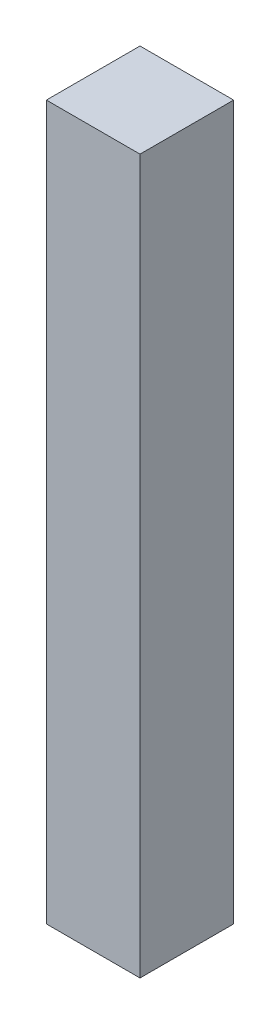
ISO-10303-21;
HEADER;
FILE_DESCRIPTION(('STEP AP214'),'2;1');
FILE_NAME('part.step','',(''),(''),'','','');
FILE_SCHEMA(('AUTOMOTIVE_DESIGN { 1 0 10303 214 1 1 1 1 }'));
ENDSEC;
DATA;
#1=APPLICATION_CONTEXT('core data for automotive mechanical design processes');
#2=APPLICATION_PROTOCOL_DEFINITION('international standard','automotive_design',2000,#1);
#3=PRODUCT_CONTEXT('',#1,'mechanical');
#4=PRODUCT('Part','Part','',(#3));
#5=PRODUCT_RELATED_PRODUCT_CATEGORY('part','',(#4));
#6=PRODUCT_DEFINITION_FORMATION('','',#4);
#7=PRODUCT_DEFINITION_CONTEXT('part definition',#1,'design');
#8=PRODUCT_DEFINITION('design','',#6,#7);
#9=PRODUCT_DEFINITION_SHAPE('','',#8);
#10=(LENGTH_UNIT() NAMED_UNIT(*) SI_UNIT(.MILLI.,.METRE.));
#11=(NAMED_UNIT(*) PLANE_ANGLE_UNIT() SI_UNIT($,.RADIAN.));
#12=(NAMED_UNIT(*) SI_UNIT($,.STERADIAN.) SOLID_ANGLE_UNIT());
#13=UNCERTAINTY_MEASURE_WITH_UNIT(LENGTH_MEASURE(1.E-05),#10,'distance_accuracy_value','');
#14=(GEOMETRIC_REPRESENTATION_CONTEXT(3) GLOBAL_UNCERTAINTY_ASSIGNED_CONTEXT((#13)) GLOBAL_UNIT_ASSIGNED_CONTEXT((#10,
#11,#12)) REPRESENTATION_CONTEXT('',''));
#15=CARTESIAN_POINT('',(0.,0.,0.));
#16=DIRECTION('',(0.,0.,1.));
#17=DIRECTION('',(1.,0.,0.));
#18=AXIS2_PLACEMENT_3D('',#15,#16,#17);
#19=CARTESIAN_POINT('',(20.,304.8,20.));
#20=DIRECTION('',(-1.,0.,0.));
#21=DIRECTION('',(0.,0.,1.));
#22=AXIS2_PLACEMENT_3D('',#19,#20,#21);
#23=PLANE('',#22);
#24=DIRECTION('',(0.,0.,-1.));
#25=VECTOR('',#24,1.);
#26=CARTESIAN_POINT('',(20.,0.,20.));
#27=LINE('',#26,#25);
#28=CARTESIAN_POINT('',(20.,0.,20.));
#29=VERTEX_POINT('',#28);
#30=CARTESIAN_POINT('',(20.,0.,-20.));
#31=VERTEX_POINT('',#30);
#32=EDGE_CURVE('E100',#29,#31,#27,.T.);
#33=ORIENTED_EDGE('',*,*,#32,.T.);
#34=DIRECTION('',(0.,-1.,0.));
#35=VECTOR('',#34,1.);
#36=CARTESIAN_POINT('',(20.,304.8,-20.));
#37=LINE('',#36,#35);
#38=CARTESIAN_POINT('',(20.,304.8,-20.));
#39=VERTEX_POINT('',#38);
#40=EDGE_CURVE('E11',#39,#31,#37,.T.);
#41=ORIENTED_EDGE('',*,*,#40,.F.);
#42=DIRECTION('',(0.,0.,-1.));
#43=VECTOR('',#42,1.);
#44=CARTESIAN_POINT('',(20.,304.8,20.));
#45=LINE('',#44,#43);
#46=CARTESIAN_POINT('',(20.,304.8,20.));
#47=VERTEX_POINT('',#46);
#48=EDGE_CURVE('E88',#47,#39,#45,.T.);
#49=ORIENTED_EDGE('',*,*,#48,.F.);
#50=DIRECTION('',(0.,-1.,0.));
#51=VECTOR('',#50,1.);
#52=CARTESIAN_POINT('',(20.,304.8,20.));
#53=LINE('',#52,#51);
#54=EDGE_CURVE('E96',#47,#29,#53,.T.);
#55=ORIENTED_EDGE('',*,*,#54,.T.);
#56=EDGE_LOOP('',(#33,#41,#49,#55));
#57=FACE_BOUND('',#56,.T.);
#58=ADVANCED_FACE('F37',(#57),#23,.F.);
#59=CARTESIAN_POINT('',(-20.,304.8,-20.));
#60=DIRECTION('',(0.,0.,1.));
#61=DIRECTION('',(1.,0.,0.));
#62=AXIS2_PLACEMENT_3D('',#59,#60,#61);
#63=PLANE('',#62);
#64=DIRECTION('',(-1.,0.,0.));
#65=VECTOR('',#64,1.);
#66=CARTESIAN_POINT('',(-20.,0.,-20.));
#67=LINE('',#66,#65);
#68=CARTESIAN_POINT('',(-20.,0.,-20.));
#69=VERTEX_POINT('',#68);
#70=EDGE_CURVE('E92',#31,#69,#67,.T.);
#71=ORIENTED_EDGE('',*,*,#70,.T.);
#72=DIRECTION('',(0.,-1.,0.));
#73=VECTOR('',#72,1.);
#74=CARTESIAN_POINT('',(-20.,304.8,-20.));
#75=LINE('',#74,#73);
#76=CARTESIAN_POINT('',(-20.,304.8,-20.));
#77=VERTEX_POINT('',#76);
#78=EDGE_CURVE('E45',#77,#69,#75,.T.);
#79=ORIENTED_EDGE('',*,*,#78,.F.);
#80=DIRECTION('',(-1.,0.,0.));
#81=VECTOR('',#80,1.);
#82=CARTESIAN_POINT('',(-20.,304.8,-20.));
#83=LINE('',#82,#81);
#84=EDGE_CURVE('E83',#39,#77,#83,.T.);
#85=ORIENTED_EDGE('',*,*,#84,.F.);
#86=ORIENTED_EDGE('',*,*,#40,.T.);
#87=EDGE_LOOP('',(#71,#79,#85,#86));
#88=FACE_BOUND('',#87,.T.);
#89=ADVANCED_FACE('F91',(#88),#63,.F.);
#90=CARTESIAN_POINT('',(-20.,304.8,20.));
#91=DIRECTION('',(1.,0.,0.));
#92=DIRECTION('',(0.,0.,-1.));
#93=AXIS2_PLACEMENT_3D('',#90,#91,#92);
#94=PLANE('',#93);
#95=DIRECTION('',(0.,0.,1.));
#96=VECTOR('',#95,1.);
#97=CARTESIAN_POINT('',(-20.,0.,20.));
#98=LINE('',#97,#96);
#99=CARTESIAN_POINT('',(-20.,0.,20.));
#100=VERTEX_POINT('',#99);
#101=EDGE_CURVE('E70',#69,#100,#98,.T.);
#102=ORIENTED_EDGE('',*,*,#101,.T.);
#103=DIRECTION('',(0.,-1.,0.));
#104=VECTOR('',#103,1.);
#105=CARTESIAN_POINT('',(-20.,304.8,20.));
#106=LINE('',#105,#104);
#107=CARTESIAN_POINT('',(-20.,304.8,20.));
#108=VERTEX_POINT('',#107);
#109=EDGE_CURVE('E93',#108,#100,#106,.T.);
#110=ORIENTED_EDGE('',*,*,#109,.F.);
#111=DIRECTION('',(0.,0.,1.));
#112=VECTOR('',#111,1.);
#113=CARTESIAN_POINT('',(-20.,304.8,20.));
#114=LINE('',#113,#112);
#115=EDGE_CURVE('E86',#77,#108,#114,.T.);
#116=ORIENTED_EDGE('',*,*,#115,.F.);
#117=ORIENTED_EDGE('',*,*,#78,.T.);
#118=EDGE_LOOP('',(#102,#110,#116,#117));
#119=FACE_BOUND('',#118,.T.);
#120=ADVANCED_FACE('F94',(#119),#94,.F.);
#121=CARTESIAN_POINT('',(-20.,304.8,20.));
#122=DIRECTION('',(0.,0.,-1.));
#123=DIRECTION('',(-1.,0.,0.));
#124=AXIS2_PLACEMENT_3D('',#121,#122,#123);
#125=PLANE('',#124);
#126=DIRECTION('',(1.,0.,0.));
#127=VECTOR('',#126,1.);
#128=CARTESIAN_POINT('',(-20.,0.,20.));
#129=LINE('',#128,#127);
#130=EDGE_CURVE('E76',#100,#29,#129,.T.);
#131=ORIENTED_EDGE('',*,*,#130,.T.);
#132=ORIENTED_EDGE('',*,*,#54,.F.);
#133=DIRECTION('',(1.,0.,0.));
#134=VECTOR('',#133,1.);
#135=CARTESIAN_POINT('',(-20.,304.8,20.));
#136=LINE('',#135,#134);
#137=EDGE_CURVE('E53',#108,#47,#136,.T.);
#138=ORIENTED_EDGE('',*,*,#137,.F.);
#139=ORIENTED_EDGE('',*,*,#109,.T.);
#140=EDGE_LOOP('',(#131,#132,#138,#139));
#141=FACE_BOUND('',#140,.T.);
#142=ADVANCED_FACE('F107',(#141),#125,.F.);
#143=CARTESIAN_POINT('',(0.,304.8,0.));
#144=DIRECTION('',(0.,-1.,0.));
#145=DIRECTION('',(0.,0.,-1.));
#146=AXIS2_PLACEMENT_3D('',#143,#144,#145);
#147=PLANE('',#146);
#148=ORIENTED_EDGE('',*,*,#48,.T.);
#149=ORIENTED_EDGE('',*,*,#84,.T.);
#150=ORIENTED_EDGE('',*,*,#115,.T.);
#151=ORIENTED_EDGE('',*,*,#137,.T.);
#152=EDGE_LOOP('',(#148,#149,#150,#151));
#153=FACE_BOUND('',#152,.T.);
#154=ADVANCED_FACE('F84',(#153),#147,.F.);
#155=CARTESIAN_POINT('',(0.,0.,0.));
#156=DIRECTION('',(0.,-1.,0.));
#157=DIRECTION('',(0.,0.,-1.));
#158=AXIS2_PLACEMENT_3D('',#155,#156,#157);
#159=PLANE('',#158);
#160=ORIENTED_EDGE('',*,*,#32,.F.);
#161=ORIENTED_EDGE('',*,*,#130,.F.);
#162=ORIENTED_EDGE('',*,*,#101,.F.);
#163=ORIENTED_EDGE('',*,*,#70,.F.);
#164=EDGE_LOOP('',(#160,#161,#162,#163));
#165=FACE_BOUND('',#164,.T.);
#166=ADVANCED_FACE('F110',(#165),#159,.T.);
#167=CLOSED_SHELL('',(#58,#89,#120,#142,#154,#166));
#168=MANIFOLD_SOLID_BREP('B2',#167);
#169=ADVANCED_BREP_SHAPE_REPRESENTATION('',(#18,#168),#14);
#170=SHAPE_DEFINITION_REPRESENTATION(#9,#169);
ENDSEC;
END-ISO-10303-21;
